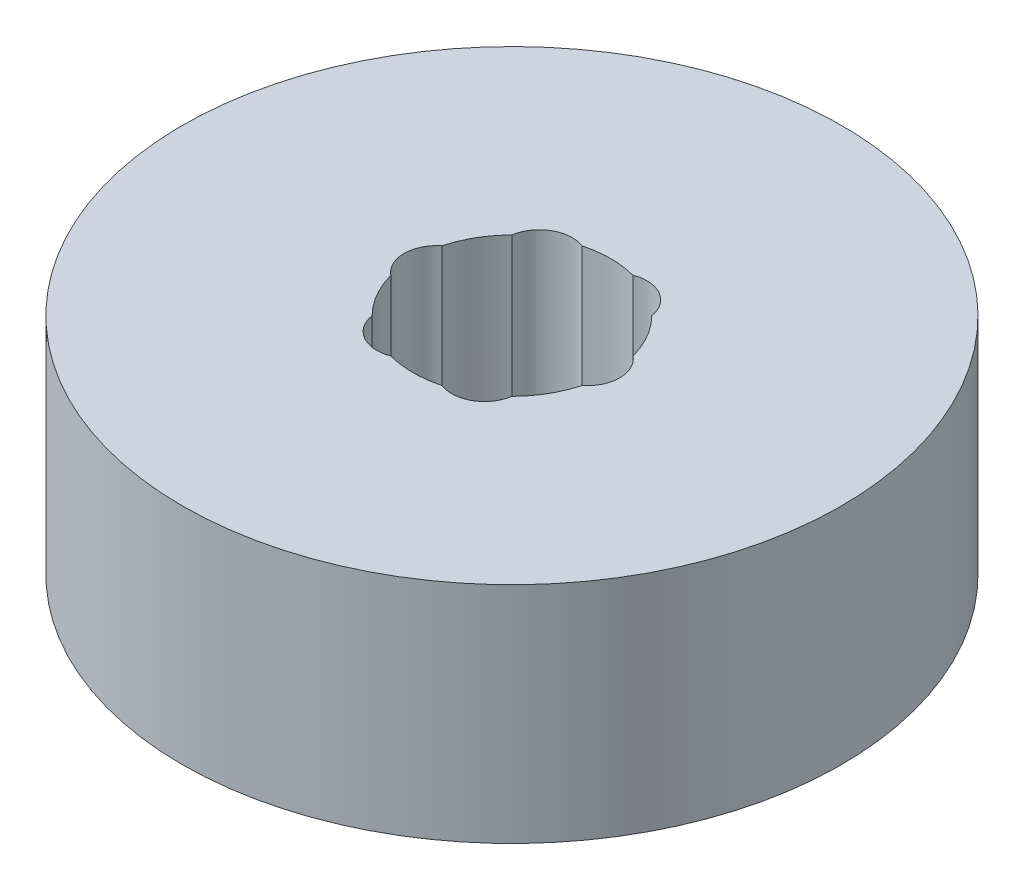
ISO-10303-21;
HEADER;
FILE_DESCRIPTION(('STEP AP214'),'2;1');
FILE_NAME('part.step','',(''),(''),'','','');
FILE_SCHEMA(('AUTOMOTIVE_DESIGN { 1 0 10303 214 1 1 1 1 }'));
ENDSEC;
DATA;
#1=APPLICATION_CONTEXT('core data for automotive mechanical design processes');
#2=APPLICATION_PROTOCOL_DEFINITION('international standard','automotive_design',2000,#1);
#3=PRODUCT_CONTEXT('',#1,'mechanical');
#4=PRODUCT('Part','Part','',(#3));
#5=PRODUCT_RELATED_PRODUCT_CATEGORY('part','',(#4));
#6=PRODUCT_DEFINITION_FORMATION('','',#4);
#7=PRODUCT_DEFINITION_CONTEXT('part definition',#1,'design');
#8=PRODUCT_DEFINITION('design','',#6,#7);
#9=PRODUCT_DEFINITION_SHAPE('','',#8);
#10=(LENGTH_UNIT() NAMED_UNIT(*) SI_UNIT(.MILLI.,.METRE.));
#11=(NAMED_UNIT(*) PLANE_ANGLE_UNIT() SI_UNIT($,.RADIAN.));
#12=(NAMED_UNIT(*) SI_UNIT($,.STERADIAN.) SOLID_ANGLE_UNIT());
#13=UNCERTAINTY_MEASURE_WITH_UNIT(LENGTH_MEASURE(1.E-05),#10,'distance_accuracy_value','');
#14=(GEOMETRIC_REPRESENTATION_CONTEXT(3) GLOBAL_UNCERTAINTY_ASSIGNED_CONTEXT((#13)) GLOBAL_UNIT_ASSIGNED_CONTEXT((#10,
#11,#12)) REPRESENTATION_CONTEXT('',''));
#15=CARTESIAN_POINT('',(0.,0.,0.));
#16=DIRECTION('',(0.,0.,1.));
#17=DIRECTION('',(1.,0.,0.));
#18=AXIS2_PLACEMENT_3D('',#15,#16,#17);
#19=CARTESIAN_POINT('',(0.,17.,0.));
#20=DIRECTION('',(0.,-1.,0.));
#21=DIRECTION('',(0.,0.,-1.));
#22=AXIS2_PLACEMENT_3D('',#19,#20,#21);
#23=CYLINDRICAL_SURFACE('',#22,25.);
#24=CARTESIAN_POINT('',(0.,17.,0.));
#25=DIRECTION('',(0.,1.,0.));
#26=DIRECTION('',(0.,0.,1.));
#27=AXIS2_PLACEMENT_3D('',#24,#25,#26);
#28=CIRCLE('',#27,25.);
#29=CARTESIAN_POINT('',(0.,17.,25.));
#30=VERTEX_POINT('',#29);
#31=EDGE_CURVE('E165',#30,#30,#28,.T.);
#32=ORIENTED_EDGE('',*,*,#31,.F.);
#33=EDGE_LOOP('',(#32));
#34=FACE_BOUND('',#33,.T.);
#35=CARTESIAN_POINT('',(0.,0.,0.));
#36=DIRECTION('',(0.,1.,0.));
#37=DIRECTION('',(0.,0.,1.));
#38=AXIS2_PLACEMENT_3D('',#35,#36,#37);
#39=CIRCLE('',#38,25.);
#40=CARTESIAN_POINT('',(0.,0.,25.));
#41=VERTEX_POINT('',#40);
#42=EDGE_CURVE('E158',#41,#41,#39,.T.);
#43=ORIENTED_EDGE('',*,*,#42,.T.);
#44=EDGE_LOOP('',(#43));
#45=FACE_BOUND('',#44,.T.);
#46=ADVANCED_FACE('F39',(#34,#45),#23,.T.);
#47=CARTESIAN_POINT('',(0.,17.,0.));
#48=DIRECTION('',(0.,1.,0.));
#49=DIRECTION('',(0.,0.,1.));
#50=AXIS2_PLACEMENT_3D('',#47,#48,#49);
#51=PLANE('',#50);
#52=CARTESIAN_POINT('',(5.6842410547662,17.,0.));
#53=DIRECTION('',(0.,1.,0.));
#54=DIRECTION('',(0.,0.,-1.));
#55=AXIS2_PLACEMENT_3D('',#52,#53,#54);
#56=CIRCLE('',#55,2.49081745860906);
#57=CARTESIAN_POINT('',(7.24427623345799,17.,1.94176771354242));
#58=VERTEX_POINT('',#57);
#59=CARTESIAN_POINT('',(7.24427623345799,17.,-1.94176771354242));
#60=VERTEX_POINT('',#59);
#61=EDGE_CURVE('E218',#58,#60,#56,.T.);
#62=ORIENTED_EDGE('',*,*,#61,.F.);
#63=CARTESIAN_POINT('',(0.,17.,0.));
#64=DIRECTION('',(0.,1.,0.));
#65=DIRECTION('',(0.,0.,1.));
#66=AXIS2_PLACEMENT_3D('',#63,#64,#65);
#67=CIRCLE('',#66,7.5);
#68=CARTESIAN_POINT('',(5.30375828490518,17.,5.30284339343523));
#69=VERTEX_POINT('',#68);
#70=EDGE_CURVE('E163',#69,#58,#67,.T.);
#71=ORIENTED_EDGE('',*,*,#70,.F.);
#72=CARTESIAN_POINT('',(2.84212052738312,17.,4.92269715466197));
#73=DIRECTION('',(0.,1.,0.));
#74=DIRECTION('',(0.866025403784436,0.,-0.500000000000004));
#75=AXIS2_PLACEMENT_3D('',#72,#73,#74);
#76=CIRCLE('',#75,2.49081745860906);
#77=CARTESIAN_POINT('',(1.94051794855287,17.,7.24461110697767));
#78=VERTEX_POINT('',#77);
#79=EDGE_CURVE('E391',#78,#69,#76,.T.);
#80=ORIENTED_EDGE('',*,*,#79,.F.);
#81=CARTESIAN_POINT('',(-1.94051794855282,17.,7.24461110697768));
#82=VERTEX_POINT('',#81);
#83=EDGE_CURVE('E149',#82,#78,#67,.T.);
#84=ORIENTED_EDGE('',*,*,#83,.F.);
#85=CARTESIAN_POINT('',(-2.84212052738309,17.,4.92269715466199));
#86=DIRECTION('',(0.,1.,0.));
#87=DIRECTION('',(0.86602540378444,0.,0.499999999999998));
#88=AXIS2_PLACEMENT_3D('',#85,#86,#87);
#89=CIRCLE('',#88,2.49081745860906);
#90=CARTESIAN_POINT('',(-5.30375828490514,17.,5.30284339343527));
#91=VERTEX_POINT('',#90);
#92=EDGE_CURVE('E128',#91,#82,#89,.T.);
#93=ORIENTED_EDGE('',*,*,#92,.F.);
#94=CARTESIAN_POINT('',(-7.24427623345799,17.,1.94176771354242));
#95=VERTEX_POINT('',#94);
#96=EDGE_CURVE('E148',#95,#91,#67,.T.);
#97=ORIENTED_EDGE('',*,*,#96,.F.);
#98=CARTESIAN_POINT('',(-5.6842410547662,17.,0.));
#99=DIRECTION('',(0.,1.,0.));
#100=DIRECTION('',(0.,0.,1.));
#101=AXIS2_PLACEMENT_3D('',#98,#99,#100);
#102=CIRCLE('',#101,2.49081745860906);
#103=CARTESIAN_POINT('',(-7.24427623345799,17.,-1.94176771354242));
#104=VERTEX_POINT('',#103);
#105=EDGE_CURVE('E178',#104,#95,#102,.T.);
#106=ORIENTED_EDGE('',*,*,#105,.F.);
#107=CARTESIAN_POINT('',(-5.30375828490522,17.,-5.30284339343519));
#108=VERTEX_POINT('',#107);
#109=EDGE_CURVE('E159',#108,#104,#67,.T.);
#110=ORIENTED_EDGE('',*,*,#109,.F.);
#111=CARTESIAN_POINT('',(-2.84212052738316,17.,-4.92269715466195));
#112=DIRECTION('',(0.,1.,0.));
#113=DIRECTION('',(-0.866025403784433,0.,0.50000000000001));
#114=AXIS2_PLACEMENT_3D('',#111,#112,#113);
#115=CIRCLE('',#114,2.49081745860906);
#116=CARTESIAN_POINT('',(-1.94051794855292,17.,-7.24461110697765));
#117=VERTEX_POINT('',#116);
#118=EDGE_CURVE('E376',#117,#108,#115,.T.);
#119=ORIENTED_EDGE('',*,*,#118,.F.);
#120=CARTESIAN_POINT('',(1.94051794855277,17.,-7.24461110697769));
#121=VERTEX_POINT('',#120);
#122=EDGE_CURVE('E170',#121,#117,#67,.T.);
#123=ORIENTED_EDGE('',*,*,#122,.F.);
#124=CARTESIAN_POINT('',(2.84212052738305,17.,-4.922697154662));
#125=DIRECTION('',(0.,1.,0.));
#126=DIRECTION('',(-0.866025403784443,0.,-0.499999999999992));
#127=AXIS2_PLACEMENT_3D('',#124,#125,#126);
#128=CIRCLE('',#127,2.49081745860906);
#129=CARTESIAN_POINT('',(5.30375828490511,17.,-5.3028433934353));
#130=VERTEX_POINT('',#129);
#131=EDGE_CURVE('E384',#130,#121,#128,.T.);
#132=ORIENTED_EDGE('',*,*,#131,.F.);
#133=EDGE_CURVE('E173',#60,#130,#67,.T.);
#134=ORIENTED_EDGE('',*,*,#133,.F.);
#135=EDGE_LOOP('',(#62,#71,#80,#84,#93,#97,#106,#110,#119,#123,#132,#134));
#136=FACE_BOUND('',#135,.T.);
#137=ORIENTED_EDGE('',*,*,#31,.T.);
#138=EDGE_LOOP('',(#137));
#139=FACE_BOUND('',#138,.T.);
#140=ADVANCED_FACE('F141',(#136,#139),#51,.T.);
#141=CARTESIAN_POINT('',(0.,0.,0.));
#142=DIRECTION('',(0.,1.,0.));
#143=DIRECTION('',(0.,0.,1.));
#144=AXIS2_PLACEMENT_3D('',#141,#142,#143);
#145=PLANE('',#144);
#146=CARTESIAN_POINT('',(0.,0.,0.));
#147=DIRECTION('',(0.,1.,0.));
#148=DIRECTION('',(0.,0.,1.));
#149=AXIS2_PLACEMENT_3D('',#146,#147,#148);
#150=CIRCLE('',#149,7.5);
#151=CARTESIAN_POINT('',(0.,0.,7.5));
#152=VERTEX_POINT('',#151);
#153=EDGE_CURVE('E169',#152,#152,#150,.T.);
#154=ORIENTED_EDGE('',*,*,#153,.T.);
#155=EDGE_LOOP('',(#154));
#156=FACE_BOUND('',#155,.T.);
#157=ORIENTED_EDGE('',*,*,#42,.F.);
#158=EDGE_LOOP('',(#157));
#159=FACE_BOUND('',#158,.T.);
#160=ADVANCED_FACE('F236',(#156,#159),#145,.F.);
#161=CARTESIAN_POINT('',(0.,17.,0.));
#162=DIRECTION('',(0.,-1.,0.));
#163=DIRECTION('',(0.,0.,-1.));
#164=AXIS2_PLACEMENT_3D('',#161,#162,#163);
#165=CYLINDRICAL_SURFACE('',#164,7.5);
#166=DIRECTION('',(0.,1.,0.));
#167=VECTOR('',#166,1.);
#168=CARTESIAN_POINT('',(7.24427623345799,8.52048325051699,1.94176771354242));
#169=LINE('',#168,#167);
#170=CARTESIAN_POINT('',(7.24427623345799,0.0409665010339851,1.94176771354242));
#171=VERTEX_POINT('',#170);
#172=EDGE_CURVE('E11',#171,#58,#169,.T.);
#173=ORIENTED_EDGE('',*,*,#172,.F.);
#174=CARTESIAN_POINT('',(0.,0.0409665010339851,0.));
#175=DIRECTION('',(0.,1.,0.));
#176=DIRECTION('',(0.,0.,1.));
#177=AXIS2_PLACEMENT_3D('',#174,#175,#176);
#178=CIRCLE('',#177,7.5);
#179=CARTESIAN_POINT('',(7.24427623345799,0.0409665010339851,-1.94176771354242));
#180=VERTEX_POINT('',#179);
#181=EDGE_CURVE('E212',#171,#180,#178,.T.);
#182=ORIENTED_EDGE('',*,*,#181,.T.);
#183=DIRECTION('',(0.,1.,0.));
#184=VECTOR('',#183,1.);
#185=CARTESIAN_POINT('',(7.24427623345799,8.52048325051699,-1.94176771354242));
#186=LINE('',#185,#184);
#187=EDGE_CURVE('E46',#60,#180,#186,.F.);
#188=ORIENTED_EDGE('',*,*,#187,.F.);
#189=ORIENTED_EDGE('',*,*,#133,.T.);
#190=DIRECTION('',(0.,1.,0.));
#191=VECTOR('',#190,1.);
#192=CARTESIAN_POINT('',(5.30375828490511,8.52048325051699,-5.3028433934353));
#193=LINE('',#192,#191);
#194=CARTESIAN_POINT('',(5.30375828490511,0.0409665010339851,-5.3028433934353));
#195=VERTEX_POINT('',#194);
#196=EDGE_CURVE('E202',#195,#130,#193,.T.);
#197=ORIENTED_EDGE('',*,*,#196,.F.);
#198=CARTESIAN_POINT('',(0.,0.0409665010339851,0.));
#199=DIRECTION('',(0.,1.,0.));
#200=DIRECTION('',(0.,0.,1.));
#201=AXIS2_PLACEMENT_3D('',#198,#199,#200);
#202=CIRCLE('',#201,7.5);
#203=CARTESIAN_POINT('',(1.94051794855277,0.0409665010339851,-7.24461110697769));
#204=VERTEX_POINT('',#203);
#205=EDGE_CURVE('E200',#195,#204,#202,.T.);
#206=ORIENTED_EDGE('',*,*,#205,.T.);
#207=DIRECTION('',(0.,1.,0.));
#208=VECTOR('',#207,1.);
#209=CARTESIAN_POINT('',(1.94051794855277,8.52048325051699,-7.24461110697769));
#210=LINE('',#209,#208);
#211=EDGE_CURVE('E205',#121,#204,#210,.F.);
#212=ORIENTED_EDGE('',*,*,#211,.F.);
#213=ORIENTED_EDGE('',*,*,#122,.T.);
#214=DIRECTION('',(0.,1.,0.));
#215=VECTOR('',#214,1.);
#216=CARTESIAN_POINT('',(-1.94051794855292,8.52048325051699,-7.24461110697765));
#217=LINE('',#216,#215);
#218=CARTESIAN_POINT('',(-1.94051794855292,0.0409665010339851,-7.24461110697765));
#219=VERTEX_POINT('',#218);
#220=EDGE_CURVE('E197',#219,#117,#217,.T.);
#221=ORIENTED_EDGE('',*,*,#220,.F.);
#222=CARTESIAN_POINT('',(0.,0.0409665010339851,0.));
#223=DIRECTION('',(0.,1.,0.));
#224=DIRECTION('',(0.,0.,1.));
#225=AXIS2_PLACEMENT_3D('',#222,#223,#224);
#226=CIRCLE('',#225,7.5);
#227=CARTESIAN_POINT('',(-5.30375828490522,0.0409665010339851,-5.30284339343519));
#228=VERTEX_POINT('',#227);
#229=EDGE_CURVE('E136',#219,#228,#226,.T.);
#230=ORIENTED_EDGE('',*,*,#229,.T.);
#231=DIRECTION('',(0.,1.,0.));
#232=VECTOR('',#231,1.);
#233=CARTESIAN_POINT('',(-5.30375828490522,8.52048325051699,-5.30284339343519));
#234=LINE('',#233,#232);
#235=EDGE_CURVE('E193',#108,#228,#234,.F.);
#236=ORIENTED_EDGE('',*,*,#235,.F.);
#237=ORIENTED_EDGE('',*,*,#109,.T.);
#238=DIRECTION('',(0.,1.,0.));
#239=VECTOR('',#238,1.);
#240=CARTESIAN_POINT('',(-7.24427623345799,8.52048325051699,-1.94176771354242));
#241=LINE('',#240,#239);
#242=CARTESIAN_POINT('',(-7.24427623345799,0.0409665010339851,-1.94176771354242));
#243=VERTEX_POINT('',#242);
#244=EDGE_CURVE('E190',#243,#104,#241,.T.);
#245=ORIENTED_EDGE('',*,*,#244,.F.);
#246=CARTESIAN_POINT('',(0.,0.0409665010339851,0.));
#247=DIRECTION('',(0.,1.,0.));
#248=DIRECTION('',(0.,0.,1.));
#249=AXIS2_PLACEMENT_3D('',#246,#247,#248);
#250=CIRCLE('',#249,7.5);
#251=CARTESIAN_POINT('',(-7.24427623345799,0.0409665010339851,1.94176771354242));
#252=VERTEX_POINT('',#251);
#253=EDGE_CURVE('E181',#243,#252,#250,.T.);
#254=ORIENTED_EDGE('',*,*,#253,.T.);
#255=DIRECTION('',(0.,1.,0.));
#256=VECTOR('',#255,1.);
#257=CARTESIAN_POINT('',(-7.24427623345799,8.52048325051699,1.94176771354242));
#258=LINE('',#257,#256);
#259=EDGE_CURVE('E160',#95,#252,#258,.F.);
#260=ORIENTED_EDGE('',*,*,#259,.F.);
#261=ORIENTED_EDGE('',*,*,#96,.T.);
#262=DIRECTION('',(0.,1.,0.));
#263=VECTOR('',#262,1.);
#264=CARTESIAN_POINT('',(-5.30375828490514,8.52048325051699,5.30284339343527));
#265=LINE('',#264,#263);
#266=CARTESIAN_POINT('',(-5.30375828490514,0.0409665010339851,5.30284339343527));
#267=VERTEX_POINT('',#266);
#268=EDGE_CURVE('E127',#267,#91,#265,.T.);
#269=ORIENTED_EDGE('',*,*,#268,.F.);
#270=CARTESIAN_POINT('',(0.,0.0409665010339851,0.));
#271=DIRECTION('',(0.,1.,0.));
#272=DIRECTION('',(0.,0.,1.));
#273=AXIS2_PLACEMENT_3D('',#270,#271,#272);
#274=CIRCLE('',#273,7.5);
#275=CARTESIAN_POINT('',(-1.94051794855282,0.0409665010339851,7.24461110697768));
#276=VERTEX_POINT('',#275);
#277=EDGE_CURVE('E188',#267,#276,#274,.T.);
#278=ORIENTED_EDGE('',*,*,#277,.T.);
#279=DIRECTION('',(0.,1.,0.));
#280=VECTOR('',#279,1.);
#281=CARTESIAN_POINT('',(-1.94051794855281,8.52048325051699,7.24461110697768));
#282=LINE('',#281,#280);
#283=EDGE_CURVE('E140',#82,#276,#282,.F.);
#284=ORIENTED_EDGE('',*,*,#283,.F.);
#285=ORIENTED_EDGE('',*,*,#83,.T.);
#286=DIRECTION('',(0.,1.,0.));
#287=VECTOR('',#286,1.);
#288=CARTESIAN_POINT('',(1.94051794855287,8.52048325051699,7.24461110697767));
#289=LINE('',#288,#287);
#290=CARTESIAN_POINT('',(1.94051794855287,0.0409665010339851,7.24461110697767));
#291=VERTEX_POINT('',#290);
#292=EDGE_CURVE('E215',#291,#78,#289,.T.);
#293=ORIENTED_EDGE('',*,*,#292,.F.);
#294=CARTESIAN_POINT('',(0.,0.0409665010339851,0.));
#295=DIRECTION('',(0.,1.,0.));
#296=DIRECTION('',(0.,0.,1.));
#297=AXIS2_PLACEMENT_3D('',#294,#295,#296);
#298=CIRCLE('',#297,7.5);
#299=CARTESIAN_POINT('',(5.30375828490518,0.0409665010339851,5.30284339343523));
#300=VERTEX_POINT('',#299);
#301=EDGE_CURVE('E210',#291,#300,#298,.T.);
#302=ORIENTED_EDGE('',*,*,#301,.T.);
#303=DIRECTION('',(0.,1.,0.));
#304=VECTOR('',#303,1.);
#305=CARTESIAN_POINT('',(5.30375828490518,8.52048325051699,5.30284339343523));
#306=LINE('',#305,#304);
#307=EDGE_CURVE('E209',#69,#300,#306,.F.);
#308=ORIENTED_EDGE('',*,*,#307,.F.);
#309=ORIENTED_EDGE('',*,*,#70,.T.);
#310=EDGE_LOOP('',(#173,#182,#188,#189,#197,#206,#212,#213,#221,#230,#236,#237,#245,#254,#260,
#261,#269,#278,#284,#285,#293,#302,#308,#309));
#311=FACE_BOUND('',#310,.T.);
#312=ORIENTED_EDGE('',*,*,#153,.F.);
#313=EDGE_LOOP('',(#312));
#314=FACE_BOUND('',#313,.T.);
#315=ADVANCED_FACE('F153',(#311,#314),#165,.F.);
#316=CARTESIAN_POINT('',(-5.6842410547662,0.0409665010339851,0.));
#317=DIRECTION('',(0.,1.,0.));
#318=DIRECTION('',(0.,0.,1.));
#319=AXIS2_PLACEMENT_3D('',#316,#317,#318);
#320=CYLINDRICAL_SURFACE('',#319,2.49081745860906);
#321=ORIENTED_EDGE('',*,*,#244,.T.);
#322=ORIENTED_EDGE('',*,*,#105,.T.);
#323=ORIENTED_EDGE('',*,*,#259,.T.);
#324=CARTESIAN_POINT('',(-5.6842410547662,0.0409665010339851,0.));
#325=DIRECTION('',(0.,1.,0.));
#326=DIRECTION('',(0.,0.,1.));
#327=AXIS2_PLACEMENT_3D('',#324,#325,#326);
#328=CIRCLE('',#327,2.49081745860906);
#329=EDGE_CURVE('E176',#243,#252,#328,.T.);
#330=ORIENTED_EDGE('',*,*,#329,.F.);
#331=EDGE_LOOP('',(#321,#322,#323,#330));
#332=FACE_BOUND('',#331,.T.);
#333=ADVANCED_FACE('F247',(#332),#320,.F.);
#334=CARTESIAN_POINT('',(-5.6842410547662,0.0409665010339851,0.));
#335=DIRECTION('',(0.,1.,0.));
#336=DIRECTION('',(0.,0.,1.));
#337=AXIS2_PLACEMENT_3D('',#334,#335,#336);
#338=PLANE('',#337);
#339=ORIENTED_EDGE('',*,*,#329,.T.);
#340=ORIENTED_EDGE('',*,*,#253,.F.);
#341=EDGE_LOOP('',(#339,#340));
#342=FACE_BOUND('',#341,.T.);
#343=ADVANCED_FACE('F252',(#342),#338,.T.);
#344=CARTESIAN_POINT('',(-2.84212052738309,0.0409665010339851,4.92269715466199));
#345=DIRECTION('',(0.,1.,0.));
#346=DIRECTION('',(0.,0.,1.));
#347=AXIS2_PLACEMENT_3D('',#344,#345,#346);
#348=CYLINDRICAL_SURFACE('',#347,2.49081745860906);
#349=ORIENTED_EDGE('',*,*,#268,.T.);
#350=ORIENTED_EDGE('',*,*,#92,.T.);
#351=ORIENTED_EDGE('',*,*,#283,.T.);
#352=CARTESIAN_POINT('',(-2.84212052738309,0.0409665010339851,4.92269715466199));
#353=DIRECTION('',(0.,1.,0.));
#354=DIRECTION('',(0.86602540378444,0.,0.499999999999998));
#355=AXIS2_PLACEMENT_3D('',#352,#353,#354);
#356=CIRCLE('',#355,2.49081745860906);
#357=EDGE_CURVE('E135',#267,#276,#356,.T.);
#358=ORIENTED_EDGE('',*,*,#357,.F.);
#359=EDGE_LOOP('',(#349,#350,#351,#358));
#360=FACE_BOUND('',#359,.T.);
#361=ADVANCED_FACE('F126',(#360),#348,.F.);
#362=CARTESIAN_POINT('',(-2.84212052738309,0.0409665010339851,4.92269715466199));
#363=DIRECTION('',(0.,1.,0.));
#364=DIRECTION('',(0.86602540378444,0.,0.499999999999998));
#365=AXIS2_PLACEMENT_3D('',#362,#363,#364);
#366=PLANE('',#365);
#367=ORIENTED_EDGE('',*,*,#357,.T.);
#368=ORIENTED_EDGE('',*,*,#277,.F.);
#369=EDGE_LOOP('',(#367,#368));
#370=FACE_BOUND('',#369,.T.);
#371=ADVANCED_FACE('F259',(#370),#366,.T.);
#372=CARTESIAN_POINT('',(-2.84212052738316,0.0409665010339851,-4.92269715466195));
#373=DIRECTION('',(0.,1.,0.));
#374=DIRECTION('',(0.,0.,1.));
#375=AXIS2_PLACEMENT_3D('',#372,#373,#374);
#376=CYLINDRICAL_SURFACE('',#375,2.49081745860906);
#377=ORIENTED_EDGE('',*,*,#220,.T.);
#378=ORIENTED_EDGE('',*,*,#118,.T.);
#379=ORIENTED_EDGE('',*,*,#235,.T.);
#380=CARTESIAN_POINT('',(-2.84212052738316,0.0409665010339851,-4.92269715466195));
#381=DIRECTION('',(0.,1.,0.));
#382=DIRECTION('',(-0.866025403784433,0.,0.50000000000001));
#383=AXIS2_PLACEMENT_3D('',#380,#381,#382);
#384=CIRCLE('',#383,2.49081745860906);
#385=EDGE_CURVE('E380',#219,#228,#384,.T.);
#386=ORIENTED_EDGE('',*,*,#385,.F.);
#387=EDGE_LOOP('',(#377,#378,#379,#386));
#388=FACE_BOUND('',#387,.T.);
#389=ADVANCED_FACE('F265',(#388),#376,.F.);
#390=CARTESIAN_POINT('',(-2.84212052738316,0.0409665010339851,-4.92269715466195));
#391=DIRECTION('',(0.,1.,0.));
#392=DIRECTION('',(-0.866025403784433,0.,0.50000000000001));
#393=AXIS2_PLACEMENT_3D('',#390,#391,#392);
#394=PLANE('',#393);
#395=ORIENTED_EDGE('',*,*,#385,.T.);
#396=ORIENTED_EDGE('',*,*,#229,.F.);
#397=EDGE_LOOP('',(#395,#396));
#398=FACE_BOUND('',#397,.T.);
#399=ADVANCED_FACE('F308',(#398),#394,.T.);
#400=CARTESIAN_POINT('',(2.84212052738305,0.0409665010339851,-4.922697154662));
#401=DIRECTION('',(0.,1.,0.));
#402=DIRECTION('',(0.,0.,1.));
#403=AXIS2_PLACEMENT_3D('',#400,#401,#402);
#404=CYLINDRICAL_SURFACE('',#403,2.49081745860906);
#405=ORIENTED_EDGE('',*,*,#196,.T.);
#406=ORIENTED_EDGE('',*,*,#131,.T.);
#407=ORIENTED_EDGE('',*,*,#211,.T.);
#408=CARTESIAN_POINT('',(2.84212052738305,0.0409665010339851,-4.922697154662));
#409=DIRECTION('',(0.,1.,0.));
#410=DIRECTION('',(-0.866025403784443,0.,-0.499999999999992));
#411=AXIS2_PLACEMENT_3D('',#408,#409,#410);
#412=CIRCLE('',#411,2.49081745860906);
#413=EDGE_CURVE('E383',#195,#204,#412,.T.);
#414=ORIENTED_EDGE('',*,*,#413,.F.);
#415=EDGE_LOOP('',(#405,#406,#407,#414));
#416=FACE_BOUND('',#415,.T.);
#417=ADVANCED_FACE('F300',(#416),#404,.F.);
#418=CARTESIAN_POINT('',(2.84212052738305,0.0409665010339851,-4.922697154662));
#419=DIRECTION('',(0.,1.,0.));
#420=DIRECTION('',(-0.866025403784443,0.,-0.499999999999992));
#421=AXIS2_PLACEMENT_3D('',#418,#419,#420);
#422=PLANE('',#421);
#423=ORIENTED_EDGE('',*,*,#413,.T.);
#424=ORIENTED_EDGE('',*,*,#205,.F.);
#425=EDGE_LOOP('',(#423,#424));
#426=FACE_BOUND('',#425,.T.);
#427=ADVANCED_FACE('F270',(#426),#422,.T.);
#428=CARTESIAN_POINT('',(2.84212052738312,0.0409665010339851,4.92269715466197));
#429=DIRECTION('',(0.,1.,0.));
#430=DIRECTION('',(0.,0.,1.));
#431=AXIS2_PLACEMENT_3D('',#428,#429,#430);
#432=CYLINDRICAL_SURFACE('',#431,2.49081745860906);
#433=ORIENTED_EDGE('',*,*,#292,.T.);
#434=ORIENTED_EDGE('',*,*,#79,.T.);
#435=ORIENTED_EDGE('',*,*,#307,.T.);
#436=CARTESIAN_POINT('',(2.84212052738312,0.0409665010339851,4.92269715466197));
#437=DIRECTION('',(0.,1.,0.));
#438=DIRECTION('',(0.866025403784436,0.,-0.500000000000004));
#439=AXIS2_PLACEMENT_3D('',#436,#437,#438);
#440=CIRCLE('',#439,2.49081745860906);
#441=EDGE_CURVE('E56',#291,#300,#440,.T.);
#442=ORIENTED_EDGE('',*,*,#441,.F.);
#443=EDGE_LOOP('',(#433,#434,#435,#442));
#444=FACE_BOUND('',#443,.T.);
#445=ADVANCED_FACE('F262',(#444),#432,.F.);
#446=CARTESIAN_POINT('',(2.84212052738312,0.0409665010339851,4.92269715466197));
#447=DIRECTION('',(0.,1.,0.));
#448=DIRECTION('',(0.866025403784436,0.,-0.500000000000004));
#449=AXIS2_PLACEMENT_3D('',#446,#447,#448);
#450=PLANE('',#449);
#451=ORIENTED_EDGE('',*,*,#441,.T.);
#452=ORIENTED_EDGE('',*,*,#301,.F.);
#453=EDGE_LOOP('',(#451,#452));
#454=FACE_BOUND('',#453,.T.);
#455=ADVANCED_FACE('F228',(#454),#450,.T.);
#456=CARTESIAN_POINT('',(5.6842410547662,0.0409665010339851,0.));
#457=DIRECTION('',(0.,1.,0.));
#458=DIRECTION('',(0.,0.,1.));
#459=AXIS2_PLACEMENT_3D('',#456,#457,#458);
#460=CYLINDRICAL_SURFACE('',#459,2.49081745860906);
#461=ORIENTED_EDGE('',*,*,#172,.T.);
#462=ORIENTED_EDGE('',*,*,#61,.T.);
#463=ORIENTED_EDGE('',*,*,#187,.T.);
#464=CARTESIAN_POINT('',(5.6842410547662,0.0409665010339851,0.));
#465=DIRECTION('',(0.,1.,0.));
#466=DIRECTION('',(0.,0.,-1.));
#467=AXIS2_PLACEMENT_3D('',#464,#465,#466);
#468=CIRCLE('',#467,2.49081745860906);
#469=EDGE_CURVE('E55',#171,#180,#468,.T.);
#470=ORIENTED_EDGE('',*,*,#469,.F.);
#471=EDGE_LOOP('',(#461,#462,#463,#470));
#472=FACE_BOUND('',#471,.T.);
#473=ADVANCED_FACE('F217',(#472),#460,.F.);
#474=CARTESIAN_POINT('',(5.6842410547662,0.0409665010339851,0.));
#475=DIRECTION('',(0.,1.,0.));
#476=DIRECTION('',(0.,0.,-1.));
#477=AXIS2_PLACEMENT_3D('',#474,#475,#476);
#478=PLANE('',#477);
#479=ORIENTED_EDGE('',*,*,#469,.T.);
#480=ORIENTED_EDGE('',*,*,#181,.F.);
#481=EDGE_LOOP('',(#479,#480));
#482=FACE_BOUND('',#481,.T.);
#483=ADVANCED_FACE('F224',(#482),#478,.T.);
#484=CLOSED_SHELL('',(#46,#140,#160,#315,#333,#343,#361,#371,#389,#399,#417,#427,#445,#455,#473,#483));
#485=MANIFOLD_SOLID_BREP('B2',#484);
#486=ADVANCED_BREP_SHAPE_REPRESENTATION('',(#18,#485),#14);
#487=SHAPE_DEFINITION_REPRESENTATION(#9,#486);
ENDSEC;
END-ISO-10303-21;
